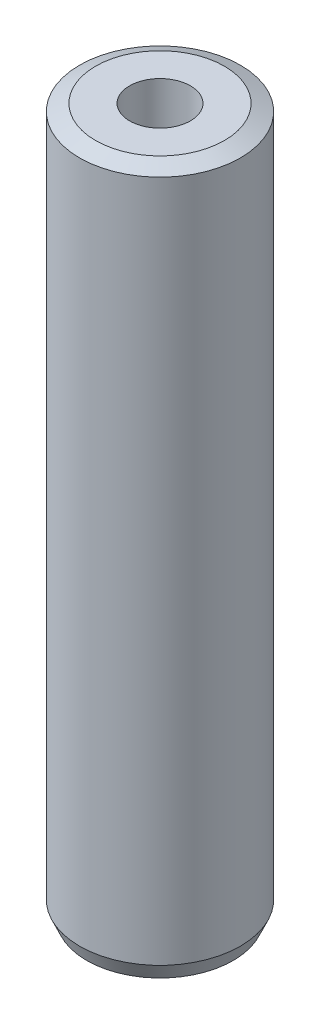
ISO-10303-21;
HEADER;
FILE_DESCRIPTION(('STEP AP214'),'2;1');
FILE_NAME('part.step','',(''),(''),'','','');
FILE_SCHEMA(('AUTOMOTIVE_DESIGN { 1 0 10303 214 1 1 1 1 }'));
ENDSEC;
DATA;
#1=APPLICATION_CONTEXT('core data for automotive mechanical design processes');
#2=APPLICATION_PROTOCOL_DEFINITION('international standard','automotive_design',2000,#1);
#3=PRODUCT_CONTEXT('',#1,'mechanical');
#4=PRODUCT('Part','Part','',(#3));
#5=PRODUCT_RELATED_PRODUCT_CATEGORY('part','',(#4));
#6=PRODUCT_DEFINITION_FORMATION('','',#4);
#7=PRODUCT_DEFINITION_CONTEXT('part definition',#1,'design');
#8=PRODUCT_DEFINITION('design','',#6,#7);
#9=PRODUCT_DEFINITION_SHAPE('','',#8);
#10=(LENGTH_UNIT() NAMED_UNIT(*) SI_UNIT(.MILLI.,.METRE.));
#11=(NAMED_UNIT(*) PLANE_ANGLE_UNIT() SI_UNIT($,.RADIAN.));
#12=(NAMED_UNIT(*) SI_UNIT($,.STERADIAN.) SOLID_ANGLE_UNIT());
#13=UNCERTAINTY_MEASURE_WITH_UNIT(LENGTH_MEASURE(1.E-05),#10,'distance_accuracy_value','');
#14=(GEOMETRIC_REPRESENTATION_CONTEXT(3) GLOBAL_UNCERTAINTY_ASSIGNED_CONTEXT((#13)) GLOBAL_UNIT_ASSIGNED_CONTEXT((#10,
#11,#12)) REPRESENTATION_CONTEXT('',''));
#15=CARTESIAN_POINT('',(0.,0.,0.));
#16=DIRECTION('',(0.,0.,1.));
#17=DIRECTION('',(1.,0.,0.));
#18=AXIS2_PLACEMENT_3D('',#15,#16,#17);
#19=CARTESIAN_POINT('',(0.,482.721061348495,0.));
#20=DIRECTION('',(0.,-1.,0.));
#21=DIRECTION('',(0.,0.,-1.));
#22=AXIS2_PLACEMENT_3D('',#19,#20,#21);
#23=CYLINDRICAL_SURFACE('',#22,55.);
#24=CARTESIAN_POINT('',(0.,477.874678905576,0.));
#25=DIRECTION('',(0.,1.,0.));
#26=DIRECTION('',(0.,0.,1.));
#27=AXIS2_PLACEMENT_3D('',#24,#25,#26);
#28=CIRCLE('',#27,55.);
#29=CARTESIAN_POINT('',(0.,477.874678905576,-55.));
#30=VERTEX_POINT('',#29);
#31=EDGE_CURVE('E50',#30,#30,#28,.F.);
#32=CARTESIAN_POINT('',(0.,10.9287533730106,0.));
#33=DIRECTION('',(0.,1.,0.));
#34=DIRECTION('',(0.,0.,1.));
#35=AXIS2_PLACEMENT_3D('',#32,#33,#34);
#36=CIRCLE('',#35,55.);
#37=CARTESIAN_POINT('',(0.,10.9287533730106,-55.));
#38=VERTEX_POINT('',#37);
#39=EDGE_CURVE('E51',#38,#38,#36,.T.);
#40=CARTESIAN_POINT('',(0.,477.874678905576,-55.));
#41=CARTESIAN_POINT('',(0.,473.010658847946,-55.));
#42=CARTESIAN_POINT('',(0.,468.146638790315,-55.));
#43=CARTESIAN_POINT('',(0.,458.418598675053,-55.));
#44=CARTESIAN_POINT('',(0.,453.554578617422,-55.));
#45=CARTESIAN_POINT('',(0.,443.82653850216,-55.));
#46=CARTESIAN_POINT('',(0.,438.962518444529,-55.));
#47=CARTESIAN_POINT('',(0.,429.234478329267,-55.));
#48=CARTESIAN_POINT('',(0.,424.370458271637,-55.));
#49=CARTESIAN_POINT('',(0.,414.642418156375,-55.));
#50=CARTESIAN_POINT('',(0.,409.778398098744,-55.));
#51=CARTESIAN_POINT('',(0.,400.050357983482,-55.));
#52=CARTESIAN_POINT('',(0.,395.186337925851,-55.));
#53=CARTESIAN_POINT('',(0.,385.458297810589,-55.));
#54=CARTESIAN_POINT('',(0.,380.594277752959,-55.));
#55=CARTESIAN_POINT('',(0.,370.866237637697,-55.));
#56=CARTESIAN_POINT('',(0.,366.002217580066,-55.));
#57=CARTESIAN_POINT('',(0.,356.274177464804,-55.));
#58=CARTESIAN_POINT('',(0.,351.410157407173,-55.));
#59=CARTESIAN_POINT('',(0.,341.682117291911,-55.));
#60=CARTESIAN_POINT('',(0.,336.818097234281,-55.));
#61=CARTESIAN_POINT('',(0.,327.090057119019,-55.));
#62=CARTESIAN_POINT('',(0.,322.226037061388,-55.));
#63=CARTESIAN_POINT('',(0.,312.497996946126,-55.));
#64=CARTESIAN_POINT('',(0.,307.633976888495,-55.));
#65=CARTESIAN_POINT('',(0.,297.905936773233,-55.));
#66=CARTESIAN_POINT('',(0.,293.041916715602,-55.));
#67=CARTESIAN_POINT('',(0.,283.313876600341,-55.));
#68=CARTESIAN_POINT('',(0.,278.44985654271,-55.));
#69=CARTESIAN_POINT('',(0.,268.721816427448,-55.));
#70=CARTESIAN_POINT('',(0.,263.857796369817,-55.));
#71=CARTESIAN_POINT('',(0.,254.129756254555,-55.));
#72=CARTESIAN_POINT('',(0.,249.265736196924,-55.));
#73=CARTESIAN_POINT('',(0.,239.537696081663,-55.));
#74=CARTESIAN_POINT('',(0.,234.673676024032,-55.));
#75=CARTESIAN_POINT('',(0.,224.94563590877,-55.));
#76=CARTESIAN_POINT('',(0.,220.081615851139,-55.));
#77=CARTESIAN_POINT('',(0.,210.353575735877,-55.));
#78=CARTESIAN_POINT('',(0.,205.489555678246,-55.));
#79=CARTESIAN_POINT('',(0.,195.761515562985,-55.));
#80=CARTESIAN_POINT('',(0.,190.897495505354,-55.));
#81=CARTESIAN_POINT('',(0.,181.169455390092,-55.));
#82=CARTESIAN_POINT('',(0.,176.305435332461,-55.));
#83=CARTESIAN_POINT('',(0.,166.577395217199,-55.));
#84=CARTESIAN_POINT('',(0.,161.713375159568,-55.));
#85=CARTESIAN_POINT('',(0.,151.985335044307,-55.));
#86=CARTESIAN_POINT('',(0.,147.121314986676,-55.));
#87=CARTESIAN_POINT('',(0.,137.393274871414,-55.));
#88=CARTESIAN_POINT('',(0.,132.529254813783,-55.));
#89=CARTESIAN_POINT('',(0.,122.801214698521,-55.));
#90=CARTESIAN_POINT('',(0.,117.93719464089,-55.));
#91=CARTESIAN_POINT('',(0.,108.209154525628,-55.));
#92=CARTESIAN_POINT('',(0.,103.345134467998,-55.));
#93=CARTESIAN_POINT('',(0.,93.6170943527358,-55.));
#94=CARTESIAN_POINT('',(0.,88.7530742951049,-55.));
#95=CARTESIAN_POINT('',(0.,79.0250341798431,-55.));
#96=CARTESIAN_POINT('',(0.,74.1610141222122,-55.));
#97=CARTESIAN_POINT('',(0.,64.4329740069504,-55.));
#98=CARTESIAN_POINT('',(0.,59.5689539493195,-55.));
#99=CARTESIAN_POINT('',(0.,49.8409138340577,-55.));
#100=CARTESIAN_POINT('',(0.,44.9768937764268,-55.));
#101=CARTESIAN_POINT('',(0.,35.2488536611651,-55.));
#102=CARTESIAN_POINT('',(0.,30.3848336035341,-55.));
#103=CARTESIAN_POINT('',(0.,20.6567934882724,-55.));
#104=CARTESIAN_POINT('',(0.,15.7927734306415,-55.));
#105=CARTESIAN_POINT('',(0.,10.9287533730106,-55.));
#106=B_SPLINE_CURVE_WITH_KNOTS('',3,(#40,#41,#42,#43,#44,#45,#46,#47,#48,#49,#50,#51,#52,#53,
#54,#55,#56,#57,#58,#59,#60,#61,#62,#63,#64,#65,#66,#67,#68,#69,#70,#71,#72,#73,#74,#75,#76,#77,
#78,#79,#80,#81,#82,#83,#84,#85,#86,#87,#88,#89,#90,#91,#92,#93,#94,#95,#96,#97,#98,#99,#100,
#101,#102,#103,#104,#105),.UNSPECIFIED.,.F.,.F.,(4,2,2,2,2,2,2,2,2,2,2,2,2,2,2,2,2,2,2,2,2,2,2,
2,2,2,2,2,2,2,2,2,4),(0.,14.5920601728927,29.1841203457853,43.776180518678,58.3682406915707,
72.9603008644634,87.552361037356,102.144421210249,116.736481383141,131.328541556034,
145.920601728927,160.512661901819,175.104722074712,189.696782247605,204.288842420498,
218.88090259339,233.472962766283,248.065022939176,262.657083112068,277.249143284961,
291.841203457854,306.433263630746,321.025323803639,335.617383976532,350.209444149424,
364.801504322317,379.39356449521,393.985624668102,408.577684840995,423.169745013888,
437.76180518678,452.353865359673,466.945925532566),.UNSPECIFIED.);
#107=EDGE_CURVE('BSEAM39',#30,#38,#106,.T.);
#108=ORIENTED_EDGE('',*,*,#31,.T.);
#109=ORIENTED_EDGE('',*,*,#39,.T.);
#110=ORIENTED_EDGE('',*,*,#107,.T.);
#111=ORIENTED_EDGE('',*,*,#107,.F.);
#112=EDGE_LOOP('',(#108,#110,#109,#111));
#113=FACE_BOUND('',#112,.T.);
#114=ADVANCED_FACE('F39',(#113),#23,.T.);
#115=CARTESIAN_POINT('',(0.,482.721061348495,0.));
#116=DIRECTION('',(0.,1.,0.));
#117=DIRECTION('',(0.,0.,1.));
#118=AXIS2_PLACEMENT_3D('',#115,#116,#117);
#119=PLANE('',#118);
#120=CARTESIAN_POINT('',(0.,482.721061348495,0.));
#121=DIRECTION('',(0.,1.,0.));
#122=DIRECTION('',(0.,0.,1.));
#123=AXIS2_PLACEMENT_3D('',#120,#121,#122);
#124=CIRCLE('',#123,44.0712466269908);
#125=CARTESIAN_POINT('',(0.,482.721061348495,44.0712466269908));
#126=VERTEX_POINT('',#125);
#127=EDGE_CURVE('E54',#126,#126,#124,.T.);
#128=ORIENTED_EDGE('',*,*,#127,.T.);
#129=EDGE_LOOP('',(#128));
#130=FACE_BOUND('',#129,.T.);
#131=CARTESIAN_POINT('',(0.,482.721061348495,0.));
#132=DIRECTION('',(0.,1.,0.));
#133=DIRECTION('',(0.,0.,1.));
#134=AXIS2_PLACEMENT_3D('',#131,#132,#133);
#135=CIRCLE('',#134,20.801482247078);
#136=CARTESIAN_POINT('',(0.,482.721061348495,-20.801482247078));
#137=VERTEX_POINT('',#136);
#138=EDGE_CURVE('E58',#137,#137,#135,.T.);
#139=ORIENTED_EDGE('',*,*,#138,.F.);
#140=EDGE_LOOP('',(#139));
#141=FACE_BOUND('',#140,.T.);
#142=ADVANCED_FACE('F69',(#130,#141),#119,.T.);
#143=CARTESIAN_POINT('',(0.,0.,0.));
#144=DIRECTION('',(0.,1.,0.));
#145=DIRECTION('',(0.,0.,1.));
#146=AXIS2_PLACEMENT_3D('',#143,#144,#145);
#147=PLANE('',#146);
#148=CARTESIAN_POINT('',(0.,0.,0.));
#149=DIRECTION('',(0.,1.,0.));
#150=DIRECTION('',(0.,0.,1.));
#151=AXIS2_PLACEMENT_3D('',#148,#149,#150);
#152=CIRCLE('',#151,50.1536175570805);
#153=CARTESIAN_POINT('',(0.,0.,50.1536175570805));
#154=VERTEX_POINT('',#153);
#155=EDGE_CURVE('E10',#154,#154,#152,.F.);
#156=ORIENTED_EDGE('',*,*,#155,.T.);
#157=EDGE_LOOP('',(#156));
#158=FACE_BOUND('',#157,.T.);
#159=CARTESIAN_POINT('',(0.,0.,0.));
#160=DIRECTION('',(0.,1.,0.));
#161=DIRECTION('',(0.,0.,1.));
#162=AXIS2_PLACEMENT_3D('',#159,#160,#161);
#163=CIRCLE('',#162,20.801482247078);
#164=CARTESIAN_POINT('',(0.,0.,-20.801482247078));
#165=VERTEX_POINT('',#164);
#166=EDGE_CURVE('E63',#165,#165,#163,.T.);
#167=ORIENTED_EDGE('',*,*,#166,.T.);
#168=EDGE_LOOP('',(#167));
#169=FACE_BOUND('',#168,.T.);
#170=ADVANCED_FACE('F75',(#158,#169),#147,.F.);
#171=CARTESIAN_POINT('',(0.,482.721061348495,0.));
#172=DIRECTION('',(0.,-1.,0.));
#173=DIRECTION('',(0.,0.,-1.));
#174=AXIS2_PLACEMENT_3D('',#171,#172,#173);
#175=CYLINDRICAL_SURFACE('',#174,20.801482247078);
#176=CARTESIAN_POINT('',(0.,482.721061348495,-20.801482247078));
#177=CARTESIAN_POINT('',(0.,477.692716959449,-20.801482247078));
#178=CARTESIAN_POINT('',(0.,472.664372570402,-20.801482247078));
#179=CARTESIAN_POINT('',(0.,462.607683792308,-20.801482247078));
#180=CARTESIAN_POINT('',(0.,457.579339403261,-20.801482247078));
#181=CARTESIAN_POINT('',(0.,447.522650625168,-20.801482247078));
#182=CARTESIAN_POINT('',(0.,442.494306236121,-20.801482247078));
#183=CARTESIAN_POINT('',(0.,432.437617458027,-20.801482247078));
#184=CARTESIAN_POINT('',(0.,427.40927306898,-20.801482247078));
#185=CARTESIAN_POINT('',(0.,417.352584290887,-20.801482247078));
#186=CARTESIAN_POINT('',(0.,412.32423990184,-20.801482247078));
#187=CARTESIAN_POINT('',(0.,402.267551123746,-20.801482247078));
#188=CARTESIAN_POINT('',(0.,397.239206734699,-20.801482247078));
#189=CARTESIAN_POINT('',(0.,387.182517956606,-20.801482247078));
#190=CARTESIAN_POINT('',(0.,382.154173567559,-20.801482247078));
#191=CARTESIAN_POINT('',(0.,372.097484789465,-20.801482247078));
#192=CARTESIAN_POINT('',(0.,367.069140400418,-20.801482247078));
#193=CARTESIAN_POINT('',(0.,357.012451622325,-20.801482247078));
#194=CARTESIAN_POINT('',(0.,351.984107233278,-20.801482247078));
#195=CARTESIAN_POINT('',(0.,341.927418455184,-20.801482247078));
#196=CARTESIAN_POINT('',(0.,336.899074066137,-20.801482247078));
#197=CARTESIAN_POINT('',(0.,326.842385288044,-20.801482247078));
#198=CARTESIAN_POINT('',(0.,321.814040898997,-20.801482247078));
#199=CARTESIAN_POINT('',(0.,311.757352120903,-20.801482247078));
#200=CARTESIAN_POINT('',(0.,306.729007731856,-20.801482247078));
#201=CARTESIAN_POINT('',(0.,296.672318953763,-20.801482247078));
#202=CARTESIAN_POINT('',(0.,291.643974564716,-20.801482247078));
#203=CARTESIAN_POINT('',(0.,281.587285786622,-20.801482247078));
#204=CARTESIAN_POINT('',(0.,276.558941397575,-20.801482247078));
#205=CARTESIAN_POINT('',(0.,266.502252619482,-20.801482247078));
#206=CARTESIAN_POINT('',(0.,261.473908230435,-20.801482247078));
#207=CARTESIAN_POINT('',(0.,251.417219452341,-20.801482247078));
#208=CARTESIAN_POINT('',(0.,246.388875063295,-20.801482247078));
#209=CARTESIAN_POINT('',(0.,236.332186285201,-20.801482247078));
#210=CARTESIAN_POINT('',(0.,231.303841896154,-20.801482247078));
#211=CARTESIAN_POINT('',(0.,221.24715311806,-20.801482247078));
#212=CARTESIAN_POINT('',(0.,216.218808729014,-20.801482247078));
#213=CARTESIAN_POINT('',(0.,206.16211995092,-20.801482247078));
#214=CARTESIAN_POINT('',(0.,201.133775561873,-20.801482247078));
#215=CARTESIAN_POINT('',(0.,191.077086783779,-20.801482247078));
#216=CARTESIAN_POINT('',(0.,186.048742394733,-20.801482247078));
#217=CARTESIAN_POINT('',(0.,175.992053616639,-20.801482247078));
#218=CARTESIAN_POINT('',(0.,170.963709227592,-20.801482247078));
#219=CARTESIAN_POINT('',(0.,160.907020449498,-20.801482247078));
#220=CARTESIAN_POINT('',(0.,155.878676060452,-20.801482247078));
#221=CARTESIAN_POINT('',(0.,145.821987282358,-20.801482247078));
#222=CARTESIAN_POINT('',(0.,140.793642893311,-20.801482247078));
#223=CARTESIAN_POINT('',(0.,130.736954115217,-20.801482247078));
#224=CARTESIAN_POINT('',(0.,125.708609726171,-20.801482247078));
#225=CARTESIAN_POINT('',(0.,115.651920948077,-20.801482247078));
#226=CARTESIAN_POINT('',(0.,110.62357655903,-20.801482247078));
#227=CARTESIAN_POINT('',(0.,100.566887780937,-20.801482247078));
#228=CARTESIAN_POINT('',(0.,95.5385433918897,-20.801482247078));
#229=CARTESIAN_POINT('',(0.,85.4818546137961,-20.801482247078));
#230=CARTESIAN_POINT('',(0.,80.4535102247492,-20.801482247078));
#231=CARTESIAN_POINT('',(0.,70.3968214466556,-20.801482247078));
#232=CARTESIAN_POINT('',(0.,65.3684770576087,-20.801482247078));
#233=CARTESIAN_POINT('',(0.,55.3117882795151,-20.801482247078));
#234=CARTESIAN_POINT('',(0.,50.2834438904682,-20.801482247078));
#235=CARTESIAN_POINT('',(0.,40.2267551123746,-20.801482247078));
#236=CARTESIAN_POINT('',(0.,35.1984107233278,-20.801482247078));
#237=CARTESIAN_POINT('',(0.,25.1417219452342,-20.801482247078));
#238=CARTESIAN_POINT('',(0.,20.1133775561873,-20.801482247078));
#239=CARTESIAN_POINT('',(0.,10.0566887780937,-20.801482247078));
#240=CARTESIAN_POINT('',(0.,5.02834438904683,-20.801482247078));
#241=CARTESIAN_POINT('',(0.,0.,-20.801482247078));
#242=B_SPLINE_CURVE_WITH_KNOTS('',3,(#176,#177,#178,#179,#180,#181,#182,#183,#184,#185,#186,
#187,#188,#189,#190,#191,#192,#193,#194,#195,#196,#197,#198,#199,#200,#201,#202,#203,#204,#205,
#206,#207,#208,#209,#210,#211,#212,#213,#214,#215,#216,#217,#218,#219,#220,#221,#222,#223,#224,
#225,#226,#227,#228,#229,#230,#231,#232,#233,#234,#235,#236,#237,#238,#239,#240,#241),
.UNSPECIFIED.,.F.,.F.,(4,2,2,2,2,2,2,2,2,2,2,2,2,2,2,2,2,2,2,2,2,2,2,2,2,2,2,2,2,2,2,2,4),(0.,
15.0850331671405,30.170066334281,45.2550995014215,60.340132668562,75.4251658357024,
90.5101990028429,105.595232169983,120.680265337124,135.765298504264,150.850331671405,
165.935364838545,181.020398005686,196.105431172826,211.190464339967,226.275497507107,
241.360530674248,256.445563841388,271.530597008529,286.615630175669,301.70066334281,
316.78569650995,331.870729677091,346.955762844231,362.040796011372,377.125829178512,
392.210862345653,407.295895512793,422.380928679934,437.465961847074,452.550995014214,
467.636028181355,482.721061348495),.UNSPECIFIED.);
#243=EDGE_CURVE('BSEAM70',#137,#165,#242,.T.);
#244=ORIENTED_EDGE('',*,*,#138,.T.);
#245=ORIENTED_EDGE('',*,*,#166,.F.);
#246=ORIENTED_EDGE('',*,*,#243,.T.);
#247=ORIENTED_EDGE('',*,*,#243,.F.);
#248=EDGE_LOOP('',(#244,#246,#245,#247));
#249=FACE_BOUND('',#248,.T.);
#250=ADVANCED_FACE('F70',(#249),#175,.F.);
#251=CARTESIAN_POINT('',(0.,482.721061348495,0.));
#252=DIRECTION('',(0.,-1.,0.));
#253=DIRECTION('',(0.,0.,-1.));
#254=AXIS2_PLACEMENT_3D('',#251,#252,#253);
#255=CONICAL_SURFACE('',#254,44.0712466269908,1.15340066981416);
#256=ORIENTED_EDGE('',*,*,#31,.F.);
#257=EDGE_LOOP('',(#256));
#258=FACE_BOUND('',#257,.T.);
#259=ORIENTED_EDGE('',*,*,#127,.F.);
#260=EDGE_LOOP('',(#259));
#261=FACE_BOUND('',#260,.T.);
#262=ADVANCED_FACE('F81',(#258,#261),#255,.T.);
#263=CARTESIAN_POINT('',(0.,10.9287533730106,0.));
#264=DIRECTION('',(0.,1.,0.));
#265=DIRECTION('',(0.,0.,1.));
#266=AXIS2_PLACEMENT_3D('',#263,#264,#265);
#267=CONICAL_SURFACE('',#266,55.,0.417395656980732);
#268=ORIENTED_EDGE('',*,*,#155,.F.);
#269=EDGE_LOOP('',(#268));
#270=FACE_BOUND('',#269,.T.);
#271=ORIENTED_EDGE('',*,*,#39,.F.);
#272=EDGE_LOOP('',(#271));
#273=FACE_BOUND('',#272,.T.);
#274=ADVANCED_FACE('F45',(#270,#273),#267,.T.);
#275=CLOSED_SHELL('',(#114,#142,#170,#250,#262,#274));
#276=MANIFOLD_SOLID_BREP('B2',#275);
#277=ADVANCED_BREP_SHAPE_REPRESENTATION('',(#18,#276),#14);
#278=SHAPE_DEFINITION_REPRESENTATION(#9,#277);
ENDSEC;
END-ISO-10303-21;
